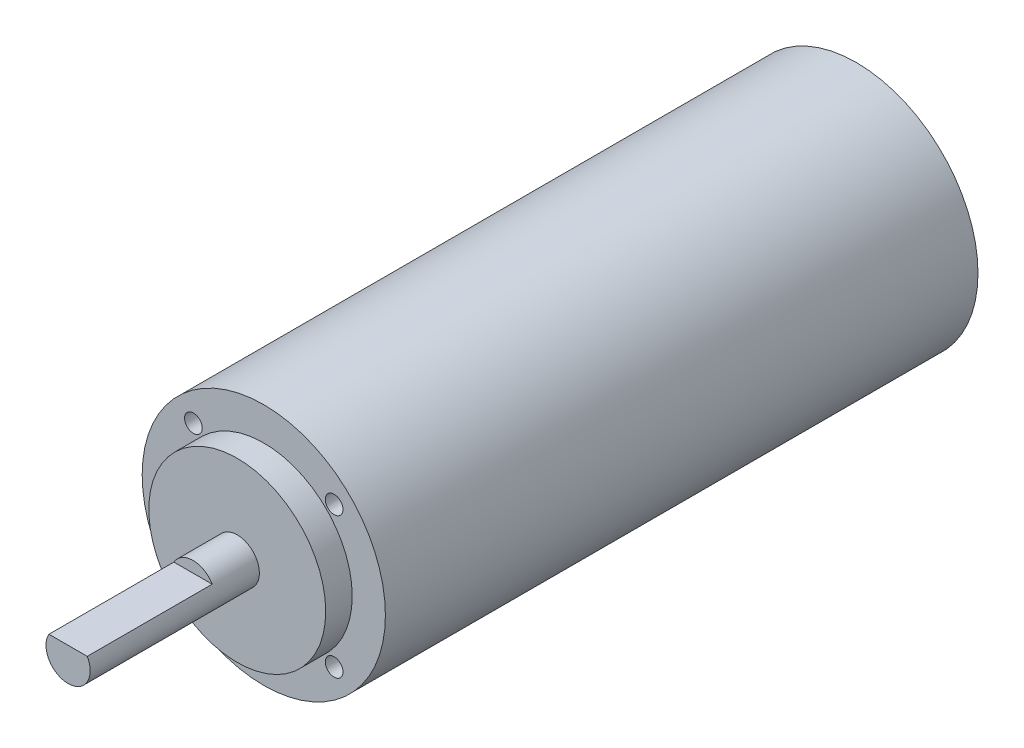
ISO-10303-21;
HEADER;
FILE_DESCRIPTION(('STEP AP214'),'2;1');
FILE_NAME('part.step','',(''),(''),'','','');
FILE_SCHEMA(('AUTOMOTIVE_DESIGN { 1 0 10303 214 1 1 1 1 }'));
ENDSEC;
DATA;
#1=APPLICATION_CONTEXT('core data for automotive mechanical design processes');
#2=APPLICATION_PROTOCOL_DEFINITION('international standard','automotive_design',2000,#1);
#3=PRODUCT_CONTEXT('',#1,'mechanical');
#4=PRODUCT('Part','Part','',(#3));
#5=PRODUCT_RELATED_PRODUCT_CATEGORY('part','',(#4));
#6=PRODUCT_DEFINITION_FORMATION('','',#4);
#7=PRODUCT_DEFINITION_CONTEXT('part definition',#1,'design');
#8=PRODUCT_DEFINITION('design','',#6,#7);
#9=PRODUCT_DEFINITION_SHAPE('','',#8);
#10=(LENGTH_UNIT() NAMED_UNIT(*) SI_UNIT(.MILLI.,.METRE.));
#11=(NAMED_UNIT(*) PLANE_ANGLE_UNIT() SI_UNIT($,.RADIAN.));
#12=(NAMED_UNIT(*) SI_UNIT($,.STERADIAN.) SOLID_ANGLE_UNIT());
#13=UNCERTAINTY_MEASURE_WITH_UNIT(LENGTH_MEASURE(1.E-05),#10,'distance_accuracy_value','');
#14=(GEOMETRIC_REPRESENTATION_CONTEXT(3) GLOBAL_UNCERTAINTY_ASSIGNED_CONTEXT((#13)) GLOBAL_UNIT_ASSIGNED_CONTEXT((#10,
#11,#12)) REPRESENTATION_CONTEXT('',''));
#15=CARTESIAN_POINT('',(0.,0.,0.));
#16=DIRECTION('',(0.,0.,1.));
#17=DIRECTION('',(1.,0.,0.));
#18=AXIS2_PLACEMENT_3D('',#15,#16,#17);
#19=CARTESIAN_POINT('',(0.,8.,0.));
#20=DIRECTION('',(0.,0.,-1.));
#21=DIRECTION('',(-1.,0.,0.));
#22=AXIS2_PLACEMENT_3D('',#19,#20,#21);
#23=PLANE('',#22);
#24=CARTESIAN_POINT('',(6.36396103067893,-6.36396103067893,0.));
#25=DIRECTION('',(0.,0.,1.));
#26=DIRECTION('',(1.,0.,0.));
#27=AXIS2_PLACEMENT_3D('',#24,#25,#26);
#28=CIRCLE('',#27,0.799999999999999);
#29=CARTESIAN_POINT('',(7.16396103067893,-6.36396103067893,0.));
#30=VERTEX_POINT('',#29);
#31=EDGE_CURVE('E93',#30,#30,#28,.T.);
#32=ORIENTED_EDGE('',*,*,#31,.F.);
#33=EDGE_LOOP('',(#32));
#34=FACE_BOUND('',#33,.T.);
#35=CARTESIAN_POINT('',(-6.36396103067892,-6.36396103067893,0.));
#36=DIRECTION('',(0.,0.,1.));
#37=DIRECTION('',(1.,0.,0.));
#38=AXIS2_PLACEMENT_3D('',#35,#36,#37);
#39=CIRCLE('',#38,0.799999999999999);
#40=CARTESIAN_POINT('',(-5.56396103067893,-6.36396103067893,0.));
#41=VERTEX_POINT('',#40);
#42=EDGE_CURVE('E104',#41,#41,#39,.T.);
#43=ORIENTED_EDGE('',*,*,#42,.F.);
#44=EDGE_LOOP('',(#43));
#45=FACE_BOUND('',#44,.T.);
#46=CARTESIAN_POINT('',(-6.36396103067893,6.36396103067893,0.));
#47=DIRECTION('',(0.,0.,1.));
#48=DIRECTION('',(1.,0.,0.));
#49=AXIS2_PLACEMENT_3D('',#46,#47,#48);
#50=CIRCLE('',#49,0.799999999999999);
#51=CARTESIAN_POINT('',(-5.56396103067893,6.36396103067893,0.));
#52=VERTEX_POINT('',#51);
#53=EDGE_CURVE('E110',#52,#52,#50,.T.);
#54=ORIENTED_EDGE('',*,*,#53,.F.);
#55=EDGE_LOOP('',(#54));
#56=FACE_BOUND('',#55,.T.);
#57=CARTESIAN_POINT('',(0.,0.,0.));
#58=DIRECTION('',(0.,0.,1.));
#59=DIRECTION('',(1.,0.,0.));
#60=AXIS2_PLACEMENT_3D('',#57,#58,#59);
#61=CIRCLE('',#60,8.);
#62=CARTESIAN_POINT('',(8.,0.,0.));
#63=VERTEX_POINT('',#62);
#64=EDGE_CURVE('E129',#63,#63,#61,.T.);
#65=ORIENTED_EDGE('',*,*,#64,.F.);
#66=EDGE_LOOP('',(#65));
#67=FACE_BOUND('',#66,.T.);
#68=CARTESIAN_POINT('',(0.,0.,0.));
#69=DIRECTION('',(0.,0.,1.));
#70=DIRECTION('',(1.,0.,0.));
#71=AXIS2_PLACEMENT_3D('',#68,#69,#70);
#72=CIRCLE('',#71,11.);
#73=CARTESIAN_POINT('',(11.,0.,0.));
#74=VERTEX_POINT('',#73);
#75=EDGE_CURVE('E126',#74,#74,#72,.T.);
#76=ORIENTED_EDGE('',*,*,#75,.T.);
#77=EDGE_LOOP('',(#76));
#78=FACE_BOUND('',#77,.T.);
#79=CARTESIAN_POINT('',(6.36396103067893,6.36396103067893,0.));
#80=DIRECTION('',(0.,0.,1.));
#81=DIRECTION('',(1.,0.,0.));
#82=AXIS2_PLACEMENT_3D('',#79,#80,#81);
#83=CIRCLE('',#82,0.8);
#84=CARTESIAN_POINT('',(7.16396103067893,6.36396103067893,0.));
#85=VERTEX_POINT('',#84);
#86=EDGE_CURVE('E94',#85,#85,#83,.T.);
#87=ORIENTED_EDGE('',*,*,#86,.F.);
#88=EDGE_LOOP('',(#87));
#89=FACE_BOUND('',#88,.T.);
#90=ADVANCED_FACE('F40',(#34,#45,#56,#67,#78,#89),#23,.F.);
#91=CARTESIAN_POINT('',(0.,2.,17.7));
#92=DIRECTION('',(0.,0.,-1.));
#93=DIRECTION('',(-1.,0.,0.));
#94=AXIS2_PLACEMENT_3D('',#91,#92,#93);
#95=PLANE('',#94);
#96=CARTESIAN_POINT('',(0.,0.,17.7));
#97=DIRECTION('',(0.,0.,1.));
#98=DIRECTION('',(1.,0.,0.));
#99=AXIS2_PLACEMENT_3D('',#96,#97,#98);
#100=CIRCLE('',#99,2.);
#101=CARTESIAN_POINT('',(-1.73205080756888,1.,17.7));
#102=VERTEX_POINT('',#101);
#103=CARTESIAN_POINT('',(1.73205080756888,1.,17.7));
#104=VERTEX_POINT('',#103);
#105=EDGE_CURVE('E13',#102,#104,#100,.T.);
#106=ORIENTED_EDGE('',*,*,#105,.T.);
#107=DIRECTION('',(1.,0.,0.));
#108=VECTOR('',#107,1.);
#109=CARTESIAN_POINT('',(1.73205080756888,1.,17.7));
#110=LINE('',#109,#108);
#111=EDGE_CURVE('E63',#102,#104,#110,.T.);
#112=ORIENTED_EDGE('',*,*,#111,.F.);
#113=EDGE_LOOP('',(#106,#112));
#114=FACE_BOUND('',#113,.T.);
#115=ADVANCED_FACE('F42',(#114),#95,.F.);
#116=CARTESIAN_POINT('',(0.,0.,0.));
#117=DIRECTION('',(0.,0.,1.));
#118=DIRECTION('',(1.,0.,0.));
#119=AXIS2_PLACEMENT_3D('',#116,#117,#118);
#120=CYLINDRICAL_SURFACE('',#119,2.);
#121=CARTESIAN_POINT('',(0.,0.,6.40000000000001));
#122=DIRECTION('',(0.,0.,-1.));
#123=DIRECTION('',(-1.,0.,0.));
#124=AXIS2_PLACEMENT_3D('',#121,#122,#123);
#125=CIRCLE('',#124,2.);
#126=CARTESIAN_POINT('',(1.73205080756888,1.,6.40000000000001));
#127=VERTEX_POINT('',#126);
#128=CARTESIAN_POINT('',(-1.73205080756888,1.,6.40000000000001));
#129=VERTEX_POINT('',#128);
#130=EDGE_CURVE('E54',#127,#129,#125,.F.);
#131=ORIENTED_EDGE('',*,*,#130,.F.);
#132=DIRECTION('',(0.,0.,1.));
#133=VECTOR('',#132,1.);
#134=CARTESIAN_POINT('',(1.73205080756888,1.,-1.20555127546398));
#135=LINE('',#134,#133);
#136=EDGE_CURVE('E120',#127,#104,#135,.T.);
#137=ORIENTED_EDGE('',*,*,#136,.T.);
#138=ORIENTED_EDGE('',*,*,#105,.F.);
#139=DIRECTION('',(0.,0.,1.));
#140=VECTOR('',#139,1.);
#141=CARTESIAN_POINT('',(-1.73205080756888,1.,-1.20555127546398));
#142=LINE('',#141,#140);
#143=EDGE_CURVE('E118',#129,#102,#142,.T.);
#144=ORIENTED_EDGE('',*,*,#143,.F.);
#145=EDGE_LOOP('',(#131,#137,#138,#144));
#146=FACE_BOUND('',#145,.T.);
#147=CARTESIAN_POINT('',(0.,0.,2.40000000000001));
#148=DIRECTION('',(0.,0.,1.));
#149=DIRECTION('',(1.,0.,0.));
#150=AXIS2_PLACEMENT_3D('',#147,#148,#149);
#151=CIRCLE('',#150,2.);
#152=CARTESIAN_POINT('',(2.,0.,2.40000000000001));
#153=VERTEX_POINT('',#152);
#154=EDGE_CURVE('E48',#153,#153,#151,.T.);
#155=ORIENTED_EDGE('',*,*,#154,.T.);
#156=EDGE_LOOP('',(#155));
#157=FACE_BOUND('',#156,.T.);
#158=ADVANCED_FACE('F137',(#146,#157),#120,.T.);
#159=CARTESIAN_POINT('',(0.,8.,2.40000000000001));
#160=DIRECTION('',(0.,0.,-1.));
#161=DIRECTION('',(-1.,0.,0.));
#162=AXIS2_PLACEMENT_3D('',#159,#160,#161);
#163=PLANE('',#162);
#164=ORIENTED_EDGE('',*,*,#154,.F.);
#165=EDGE_LOOP('',(#164));
#166=FACE_BOUND('',#165,.T.);
#167=CARTESIAN_POINT('',(0.,0.,2.40000000000001));
#168=DIRECTION('',(0.,0.,1.));
#169=DIRECTION('',(1.,0.,0.));
#170=AXIS2_PLACEMENT_3D('',#167,#168,#169);
#171=CIRCLE('',#170,8.);
#172=CARTESIAN_POINT('',(8.,0.,2.40000000000001));
#173=VERTEX_POINT('',#172);
#174=EDGE_CURVE('E132',#173,#173,#171,.T.);
#175=ORIENTED_EDGE('',*,*,#174,.T.);
#176=EDGE_LOOP('',(#175));
#177=FACE_BOUND('',#176,.T.);
#178=ADVANCED_FACE('F139',(#166,#177),#163,.F.);
#179=CARTESIAN_POINT('',(0.,0.,0.));
#180=DIRECTION('',(0.,0.,1.));
#181=DIRECTION('',(1.,0.,0.));
#182=AXIS2_PLACEMENT_3D('',#179,#180,#181);
#183=CYLINDRICAL_SURFACE('',#182,8.);
#184=ORIENTED_EDGE('',*,*,#174,.F.);
#185=EDGE_LOOP('',(#184));
#186=FACE_BOUND('',#185,.T.);
#187=ORIENTED_EDGE('',*,*,#64,.T.);
#188=EDGE_LOOP('',(#187));
#189=FACE_BOUND('',#188,.T.);
#190=ADVANCED_FACE('F142',(#186,#189),#183,.T.);
#191=CARTESIAN_POINT('',(0.,0.,0.));
#192=DIRECTION('',(0.,0.,1.));
#193=DIRECTION('',(1.,0.,0.));
#194=AXIS2_PLACEMENT_3D('',#191,#192,#193);
#195=CYLINDRICAL_SURFACE('',#194,11.);
#196=ORIENTED_EDGE('',*,*,#75,.F.);
#197=EDGE_LOOP('',(#196));
#198=FACE_BOUND('',#197,.T.);
#199=CARTESIAN_POINT('',(0.,0.,-53.6));
#200=DIRECTION('',(0.,0.,1.));
#201=DIRECTION('',(1.,0.,0.));
#202=AXIS2_PLACEMENT_3D('',#199,#200,#201);
#203=CIRCLE('',#202,11.);
#204=CARTESIAN_POINT('',(11.,0.,-53.6));
#205=VERTEX_POINT('',#204);
#206=EDGE_CURVE('E122',#205,#205,#203,.T.);
#207=ORIENTED_EDGE('',*,*,#206,.T.);
#208=EDGE_LOOP('',(#207));
#209=FACE_BOUND('',#208,.T.);
#210=ADVANCED_FACE('F148',(#198,#209),#195,.T.);
#211=CARTESIAN_POINT('',(0.,11.,-53.6));
#212=DIRECTION('',(0.,0.,1.));
#213=DIRECTION('',(1.,0.,0.));
#214=AXIS2_PLACEMENT_3D('',#211,#212,#213);
#215=PLANE('',#214);
#216=ORIENTED_EDGE('',*,*,#206,.F.);
#217=EDGE_LOOP('',(#216));
#218=FACE_BOUND('',#217,.T.);
#219=ADVANCED_FACE('F192',(#218),#215,.F.);
#220=CARTESIAN_POINT('',(0.,8.,6.40000000000001));
#221=DIRECTION('',(0.,0.,-1.));
#222=DIRECTION('',(-1.,0.,0.));
#223=AXIS2_PLACEMENT_3D('',#220,#221,#222);
#224=PLANE('',#223);
#225=DIRECTION('',(1.,0.,0.));
#226=VECTOR('',#225,1.);
#227=CARTESIAN_POINT('',(1.73205080756888,1.,6.40000000000001));
#228=LINE('',#227,#226);
#229=EDGE_CURVE('E70',#129,#127,#228,.T.);
#230=ORIENTED_EDGE('',*,*,#229,.T.);
#231=ORIENTED_EDGE('',*,*,#130,.T.);
#232=EDGE_LOOP('',(#230,#231));
#233=FACE_BOUND('',#232,.T.);
#234=ADVANCED_FACE('F189',(#233),#224,.F.);
#235=CARTESIAN_POINT('',(1.73205080756888,1.,-1.20555127546398));
#236=DIRECTION('',(0.,-1.,0.));
#237=DIRECTION('',(1.,0.,0.));
#238=AXIS2_PLACEMENT_3D('',#235,#236,#237);
#239=PLANE('',#238);
#240=ORIENTED_EDGE('',*,*,#143,.T.);
#241=ORIENTED_EDGE('',*,*,#111,.T.);
#242=ORIENTED_EDGE('',*,*,#136,.F.);
#243=ORIENTED_EDGE('',*,*,#229,.F.);
#244=EDGE_LOOP('',(#240,#241,#242,#243));
#245=FACE_BOUND('',#244,.T.);
#246=ADVANCED_FACE('F186',(#245),#239,.F.);
#247=CARTESIAN_POINT('',(-6.36396103067893,6.36396103067893,-4.));
#248=DIRECTION('',(0.,0.,1.));
#249=DIRECTION('',(1.,0.,0.));
#250=AXIS2_PLACEMENT_3D('',#247,#248,#249);
#251=CONICAL_SURFACE('',#250,0.799999999999999,1.02974425867665);
#252=CARTESIAN_POINT('',(-6.36396103067893,6.36396103067893,-4.48068849522205));
#253=VERTEX_POINT('',#252);
#254=VERTEX_LOOP('',#253);
#255=FACE_BOUND('',#254,.T.);
#256=CARTESIAN_POINT('',(-6.36396103067893,6.36396103067893,-4.));
#257=DIRECTION('',(0.,0.,1.));
#258=DIRECTION('',(1.,0.,0.));
#259=AXIS2_PLACEMENT_3D('',#256,#257,#258);
#260=CIRCLE('',#259,0.799999999999999);
#261=CARTESIAN_POINT('',(-5.56396103067893,6.36396103067893,-4.));
#262=VERTEX_POINT('',#261);
#263=EDGE_CURVE('E113',#262,#262,#260,.T.);
#264=ORIENTED_EDGE('',*,*,#263,.T.);
#265=EDGE_LOOP('',(#264));
#266=FACE_BOUND('',#265,.T.);
#267=ADVANCED_FACE('F182',(#255,#266),#251,.F.);
#268=CARTESIAN_POINT('',(-6.36396103067893,6.36396103067893,0.));
#269=DIRECTION('',(0.,0.,1.));
#270=DIRECTION('',(1.,0.,0.));
#271=AXIS2_PLACEMENT_3D('',#268,#269,#270);
#272=CYLINDRICAL_SURFACE('',#271,0.799999999999999);
#273=ORIENTED_EDGE('',*,*,#263,.F.);
#274=EDGE_LOOP('',(#273));
#275=FACE_BOUND('',#274,.T.);
#276=ORIENTED_EDGE('',*,*,#53,.T.);
#277=EDGE_LOOP('',(#276));
#278=FACE_BOUND('',#277,.T.);
#279=ADVANCED_FACE('F179',(#275,#278),#272,.F.);
#280=CARTESIAN_POINT('',(-6.36396103067892,-6.36396103067893,-4.));
#281=DIRECTION('',(0.,0.,1.));
#282=DIRECTION('',(1.,0.,0.));
#283=AXIS2_PLACEMENT_3D('',#280,#281,#282);
#284=CONICAL_SURFACE('',#283,0.799999999999999,1.02974425867665);
#285=CARTESIAN_POINT('',(-6.36396103067893,-6.36396103067893,-4.48068849522205));
#286=VERTEX_POINT('',#285);
#287=VERTEX_LOOP('',#286);
#288=FACE_BOUND('',#287,.T.);
#289=CARTESIAN_POINT('',(-6.36396103067892,-6.36396103067893,-4.));
#290=DIRECTION('',(0.,0.,1.));
#291=DIRECTION('',(1.,0.,0.));
#292=AXIS2_PLACEMENT_3D('',#289,#290,#291);
#293=CIRCLE('',#292,0.799999999999999);
#294=CARTESIAN_POINT('',(-5.56396103067893,-6.36396103067893,-4.));
#295=VERTEX_POINT('',#294);
#296=EDGE_CURVE('E107',#295,#295,#293,.T.);
#297=ORIENTED_EDGE('',*,*,#296,.T.);
#298=EDGE_LOOP('',(#297));
#299=FACE_BOUND('',#298,.T.);
#300=ADVANCED_FACE('F175',(#288,#299),#284,.F.);
#301=CARTESIAN_POINT('',(-6.36396103067892,-6.36396103067893,0.));
#302=DIRECTION('',(0.,0.,1.));
#303=DIRECTION('',(1.,0.,0.));
#304=AXIS2_PLACEMENT_3D('',#301,#302,#303);
#305=CYLINDRICAL_SURFACE('',#304,0.799999999999999);
#306=ORIENTED_EDGE('',*,*,#296,.F.);
#307=EDGE_LOOP('',(#306));
#308=FACE_BOUND('',#307,.T.);
#309=ORIENTED_EDGE('',*,*,#42,.T.);
#310=EDGE_LOOP('',(#309));
#311=FACE_BOUND('',#310,.T.);
#312=ADVANCED_FACE('F171',(#308,#311),#305,.F.);
#313=CARTESIAN_POINT('',(6.36396103067893,-6.36396103067893,-4.));
#314=DIRECTION('',(0.,0.,1.));
#315=DIRECTION('',(1.,0.,0.));
#316=AXIS2_PLACEMENT_3D('',#313,#314,#315);
#317=CONICAL_SURFACE('',#316,0.799999999999999,1.02974425867665);
#318=CARTESIAN_POINT('',(6.36396103067893,-6.36396103067893,-4.48068849522205));
#319=VERTEX_POINT('',#318);
#320=VERTEX_LOOP('',#319);
#321=FACE_BOUND('',#320,.T.);
#322=CARTESIAN_POINT('',(6.36396103067893,-6.36396103067893,-4.));
#323=DIRECTION('',(0.,0.,1.));
#324=DIRECTION('',(1.,0.,0.));
#325=AXIS2_PLACEMENT_3D('',#322,#323,#324);
#326=CIRCLE('',#325,0.799999999999999);
#327=CARTESIAN_POINT('',(7.16396103067893,-6.36396103067893,-4.));
#328=VERTEX_POINT('',#327);
#329=EDGE_CURVE('E97',#328,#328,#326,.T.);
#330=ORIENTED_EDGE('',*,*,#329,.T.);
#331=EDGE_LOOP('',(#330));
#332=FACE_BOUND('',#331,.T.);
#333=ADVANCED_FACE('F167',(#321,#332),#317,.F.);
#334=CARTESIAN_POINT('',(6.36396103067893,-6.36396103067893,0.));
#335=DIRECTION('',(0.,0.,1.));
#336=DIRECTION('',(1.,0.,0.));
#337=AXIS2_PLACEMENT_3D('',#334,#335,#336);
#338=CYLINDRICAL_SURFACE('',#337,0.799999999999999);
#339=ORIENTED_EDGE('',*,*,#329,.F.);
#340=EDGE_LOOP('',(#339));
#341=FACE_BOUND('',#340,.T.);
#342=ORIENTED_EDGE('',*,*,#31,.T.);
#343=EDGE_LOOP('',(#342));
#344=FACE_BOUND('',#343,.T.);
#345=ADVANCED_FACE('F87',(#341,#344),#338,.F.);
#346=CARTESIAN_POINT('',(6.36396103067893,6.36396103067893,-4.));
#347=DIRECTION('',(0.,0.,1.));
#348=DIRECTION('',(1.,0.,0.));
#349=AXIS2_PLACEMENT_3D('',#346,#347,#348);
#350=CONICAL_SURFACE('',#349,0.799999999999999,1.02974425867665);
#351=CARTESIAN_POINT('',(6.36396103067892,6.36396103067893,-4.48068849522205));
#352=VERTEX_POINT('',#351);
#353=VERTEX_LOOP('',#352);
#354=FACE_BOUND('',#353,.T.);
#355=CARTESIAN_POINT('',(6.36396103067893,6.36396103067893,-4.));
#356=DIRECTION('',(0.,0.,1.));
#357=DIRECTION('',(1.,0.,0.));
#358=AXIS2_PLACEMENT_3D('',#355,#356,#357);
#359=CIRCLE('',#358,0.799999999999999);
#360=CARTESIAN_POINT('',(7.16396103067893,6.36396103067893,-4.));
#361=VERTEX_POINT('',#360);
#362=EDGE_CURVE('E91',#361,#361,#359,.T.);
#363=ORIENTED_EDGE('',*,*,#362,.T.);
#364=EDGE_LOOP('',(#363));
#365=FACE_BOUND('',#364,.T.);
#366=ADVANCED_FACE('F83',(#354,#365),#350,.F.);
#367=CARTESIAN_POINT('',(6.36396103067893,6.36396103067893,0.));
#368=DIRECTION('',(0.,0.,1.));
#369=DIRECTION('',(1.,0.,0.));
#370=AXIS2_PLACEMENT_3D('',#367,#368,#369);
#371=CYLINDRICAL_SURFACE('',#370,0.8);
#372=ORIENTED_EDGE('',*,*,#362,.F.);
#373=EDGE_LOOP('',(#372));
#374=FACE_BOUND('',#373,.T.);
#375=ORIENTED_EDGE('',*,*,#86,.T.);
#376=EDGE_LOOP('',(#375));
#377=FACE_BOUND('',#376,.T.);
#378=ADVANCED_FACE('F86',(#374,#377),#371,.F.);
#379=CLOSED_SHELL('',(#90,#115,#158,#178,#190,#210,#219,#234,#246,#267,#279,#300,#312,#333,#345,
#366,#378));
#380=MANIFOLD_SOLID_BREP('B2',#379);
#381=ADVANCED_BREP_SHAPE_REPRESENTATION('',(#18,#380),#14);
#382=SHAPE_DEFINITION_REPRESENTATION(#9,#381);
ENDSEC;
END-ISO-10303-21;
